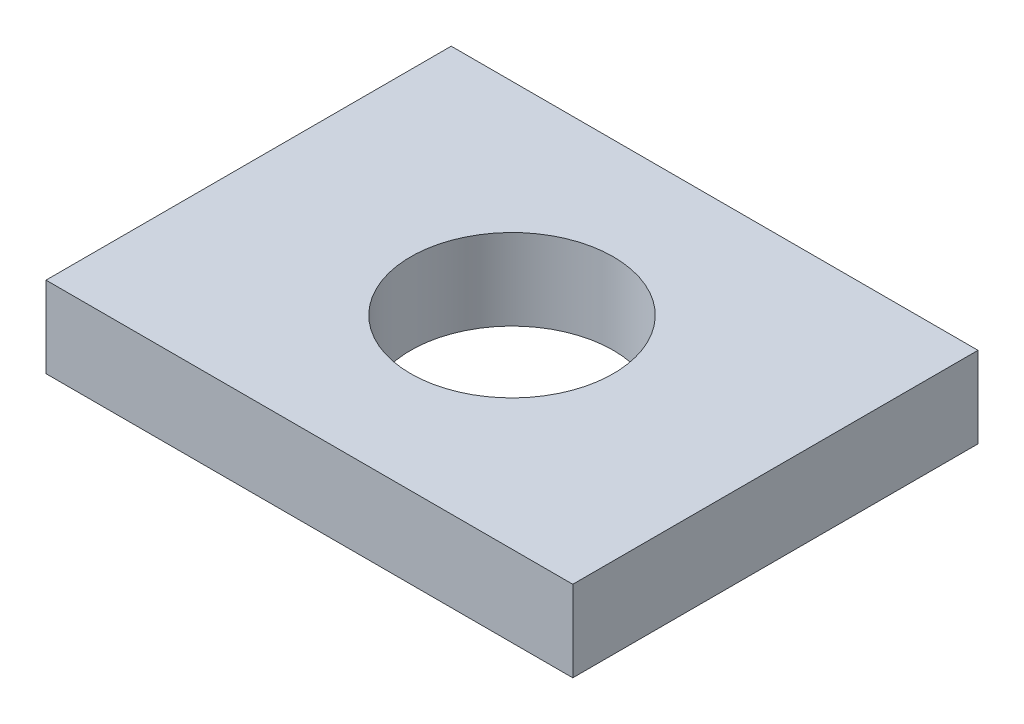
ISO-10303-21;
HEADER;
FILE_DESCRIPTION(('STEP AP214'),'2;1');
FILE_NAME('part.step','',(''),(''),'','','');
FILE_SCHEMA(('AUTOMOTIVE_DESIGN { 1 0 10303 214 1 1 1 1 }'));
ENDSEC;
DATA;
#1=APPLICATION_CONTEXT('core data for automotive mechanical design processes');
#2=APPLICATION_PROTOCOL_DEFINITION('international standard','automotive_design',2000,#1);
#3=PRODUCT_CONTEXT('',#1,'mechanical');
#4=PRODUCT('Part','Part','',(#3));
#5=PRODUCT_RELATED_PRODUCT_CATEGORY('part','',(#4));
#6=PRODUCT_DEFINITION_FORMATION('','',#4);
#7=PRODUCT_DEFINITION_CONTEXT('part definition',#1,'design');
#8=PRODUCT_DEFINITION('design','',#6,#7);
#9=PRODUCT_DEFINITION_SHAPE('','',#8);
#10=(LENGTH_UNIT() NAMED_UNIT(*) SI_UNIT(.MILLI.,.METRE.));
#11=(NAMED_UNIT(*) PLANE_ANGLE_UNIT() SI_UNIT($,.RADIAN.));
#12=(NAMED_UNIT(*) SI_UNIT($,.STERADIAN.) SOLID_ANGLE_UNIT());
#13=UNCERTAINTY_MEASURE_WITH_UNIT(LENGTH_MEASURE(1.E-05),#10,'distance_accuracy_value','');
#14=(GEOMETRIC_REPRESENTATION_CONTEXT(3) GLOBAL_UNCERTAINTY_ASSIGNED_CONTEXT((#13)) GLOBAL_UNIT_ASSIGNED_CONTEXT((#10,
#11,#12)) REPRESENTATION_CONTEXT('',''));
#15=CARTESIAN_POINT('',(0.,0.,0.));
#16=DIRECTION('',(0.,0.,1.));
#17=DIRECTION('',(1.,0.,0.));
#18=AXIS2_PLACEMENT_3D('',#15,#16,#17);
#19=CARTESIAN_POINT('',(0.,2.,0.));
#20=DIRECTION('',(0.,-1.,0.));
#21=DIRECTION('',(0.,0.,-1.));
#22=AXIS2_PLACEMENT_3D('',#19,#20,#21);
#23=PLANE('',#22);
#24=DIRECTION('',(0.,0.,-1.));
#25=VECTOR('',#24,1.);
#26=CARTESIAN_POINT('',(6.5,2.,5.));
#27=LINE('',#26,#25);
#28=CARTESIAN_POINT('',(6.5,2.,5.));
#29=VERTEX_POINT('',#28);
#30=CARTESIAN_POINT('',(6.5,2.,-5.));
#31=VERTEX_POINT('',#30);
#32=EDGE_CURVE('E96',#29,#31,#27,.T.);
#33=ORIENTED_EDGE('',*,*,#32,.T.);
#34=DIRECTION('',(-1.,0.,0.));
#35=VECTOR('',#34,1.);
#36=CARTESIAN_POINT('',(-6.5,2.,-5.));
#37=LINE('',#36,#35);
#38=CARTESIAN_POINT('',(-6.5,2.,-5.));
#39=VERTEX_POINT('',#38);
#40=EDGE_CURVE('E91',#31,#39,#37,.T.);
#41=ORIENTED_EDGE('',*,*,#40,.T.);
#42=DIRECTION('',(0.,0.,1.));
#43=VECTOR('',#42,1.);
#44=CARTESIAN_POINT('',(-6.5,2.,5.));
#45=LINE('',#44,#43);
#46=CARTESIAN_POINT('',(-6.5,2.,5.));
#47=VERTEX_POINT('',#46);
#48=EDGE_CURVE('E94',#39,#47,#45,.T.);
#49=ORIENTED_EDGE('',*,*,#48,.T.);
#50=DIRECTION('',(1.,0.,0.));
#51=VECTOR('',#50,1.);
#52=CARTESIAN_POINT('',(-6.5,2.,5.));
#53=LINE('',#52,#51);
#54=EDGE_CURVE('E61',#47,#29,#53,.T.);
#55=ORIENTED_EDGE('',*,*,#54,.T.);
#56=EDGE_LOOP('',(#33,#41,#49,#55));
#57=FACE_BOUND('',#56,.T.);
#58=CARTESIAN_POINT('',(0.,2.,0.));
#59=DIRECTION('',(0.,1.,0.));
#60=DIRECTION('',(0.,0.,1.));
#61=AXIS2_PLACEMENT_3D('',#58,#59,#60);
#62=CIRCLE('',#61,2.5);
#63=CARTESIAN_POINT('',(0.,2.,2.5));
#64=VERTEX_POINT('',#63);
#65=EDGE_CURVE('E116',#64,#64,#62,.T.);
#66=ORIENTED_EDGE('',*,*,#65,.F.);
#67=EDGE_LOOP('',(#66));
#68=FACE_BOUND('',#67,.T.);
#69=ADVANCED_FACE('F43',(#57,#68),#23,.F.);
#70=CARTESIAN_POINT('',(0.,0.,0.));
#71=DIRECTION('',(0.,-1.,0.));
#72=DIRECTION('',(0.,0.,-1.));
#73=AXIS2_PLACEMENT_3D('',#70,#71,#72);
#74=PLANE('',#73);
#75=DIRECTION('',(0.,0.,-1.));
#76=VECTOR('',#75,1.);
#77=CARTESIAN_POINT('',(6.5,0.,5.));
#78=LINE('',#77,#76);
#79=CARTESIAN_POINT('',(6.5,0.,5.));
#80=VERTEX_POINT('',#79);
#81=CARTESIAN_POINT('',(6.5,0.,-5.));
#82=VERTEX_POINT('',#81);
#83=EDGE_CURVE('E112',#80,#82,#78,.T.);
#84=ORIENTED_EDGE('',*,*,#83,.F.);
#85=DIRECTION('',(1.,0.,0.));
#86=VECTOR('',#85,1.);
#87=CARTESIAN_POINT('',(-6.5,0.,5.));
#88=LINE('',#87,#86);
#89=CARTESIAN_POINT('',(-6.5,0.,5.));
#90=VERTEX_POINT('',#89);
#91=EDGE_CURVE('E84',#90,#80,#88,.T.);
#92=ORIENTED_EDGE('',*,*,#91,.F.);
#93=DIRECTION('',(0.,0.,1.));
#94=VECTOR('',#93,1.);
#95=CARTESIAN_POINT('',(-6.5,0.,5.));
#96=LINE('',#95,#94);
#97=CARTESIAN_POINT('',(-6.5,0.,-5.));
#98=VERTEX_POINT('',#97);
#99=EDGE_CURVE('E78',#98,#90,#96,.T.);
#100=ORIENTED_EDGE('',*,*,#99,.F.);
#101=DIRECTION('',(-1.,0.,0.));
#102=VECTOR('',#101,1.);
#103=CARTESIAN_POINT('',(-6.5,0.,-5.));
#104=LINE('',#103,#102);
#105=EDGE_CURVE('E101',#82,#98,#104,.T.);
#106=ORIENTED_EDGE('',*,*,#105,.F.);
#107=EDGE_LOOP('',(#84,#92,#100,#106));
#108=FACE_BOUND('',#107,.T.);
#109=CARTESIAN_POINT('',(0.,0.,0.));
#110=DIRECTION('',(0.,1.,0.));
#111=DIRECTION('',(0.,0.,1.));
#112=AXIS2_PLACEMENT_3D('',#109,#110,#111);
#113=CIRCLE('',#112,2.5);
#114=CARTESIAN_POINT('',(0.,0.,2.5));
#115=VERTEX_POINT('',#114);
#116=EDGE_CURVE('E134',#115,#115,#113,.T.);
#117=ORIENTED_EDGE('',*,*,#116,.T.);
#118=EDGE_LOOP('',(#117));
#119=FACE_BOUND('',#118,.T.);
#120=ADVANCED_FACE('F129',(#108,#119),#74,.T.);
#121=CARTESIAN_POINT('',(6.5,2.,5.));
#122=DIRECTION('',(-1.,0.,0.));
#123=DIRECTION('',(0.,0.,1.));
#124=AXIS2_PLACEMENT_3D('',#121,#122,#123);
#125=PLANE('',#124);
#126=ORIENTED_EDGE('',*,*,#83,.T.);
#127=DIRECTION('',(0.,-1.,0.));
#128=VECTOR('',#127,1.);
#129=CARTESIAN_POINT('',(6.5,2.,-5.));
#130=LINE('',#129,#128);
#131=EDGE_CURVE('E11',#31,#82,#130,.T.);
#132=ORIENTED_EDGE('',*,*,#131,.F.);
#133=ORIENTED_EDGE('',*,*,#32,.F.);
#134=DIRECTION('',(0.,-1.,0.));
#135=VECTOR('',#134,1.);
#136=CARTESIAN_POINT('',(6.5,2.,5.));
#137=LINE('',#136,#135);
#138=EDGE_CURVE('E108',#29,#80,#137,.T.);
#139=ORIENTED_EDGE('',*,*,#138,.T.);
#140=EDGE_LOOP('',(#126,#132,#133,#139));
#141=FACE_BOUND('',#140,.T.);
#142=ADVANCED_FACE('F45',(#141),#125,.F.);
#143=CARTESIAN_POINT('',(-6.5,2.,-5.));
#144=DIRECTION('',(0.,0.,1.));
#145=DIRECTION('',(1.,0.,0.));
#146=AXIS2_PLACEMENT_3D('',#143,#144,#145);
#147=PLANE('',#146);
#148=ORIENTED_EDGE('',*,*,#105,.T.);
#149=DIRECTION('',(0.,-1.,0.));
#150=VECTOR('',#149,1.);
#151=CARTESIAN_POINT('',(-6.5,2.,-5.));
#152=LINE('',#151,#150);
#153=EDGE_CURVE('E53',#39,#98,#152,.T.);
#154=ORIENTED_EDGE('',*,*,#153,.F.);
#155=ORIENTED_EDGE('',*,*,#40,.F.);
#156=ORIENTED_EDGE('',*,*,#131,.T.);
#157=EDGE_LOOP('',(#148,#154,#155,#156));
#158=FACE_BOUND('',#157,.T.);
#159=ADVANCED_FACE('F100',(#158),#147,.F.);
#160=CARTESIAN_POINT('',(-6.5,2.,5.));
#161=DIRECTION('',(1.,0.,0.));
#162=DIRECTION('',(0.,0.,-1.));
#163=AXIS2_PLACEMENT_3D('',#160,#161,#162);
#164=PLANE('',#163);
#165=ORIENTED_EDGE('',*,*,#99,.T.);
#166=DIRECTION('',(0.,-1.,0.));
#167=VECTOR('',#166,1.);
#168=CARTESIAN_POINT('',(-6.5,2.,5.));
#169=LINE('',#168,#167);
#170=EDGE_CURVE('E103',#47,#90,#169,.T.);
#171=ORIENTED_EDGE('',*,*,#170,.F.);
#172=ORIENTED_EDGE('',*,*,#48,.F.);
#173=ORIENTED_EDGE('',*,*,#153,.T.);
#174=EDGE_LOOP('',(#165,#171,#172,#173));
#175=FACE_BOUND('',#174,.T.);
#176=ADVANCED_FACE('F104',(#175),#164,.F.);
#177=CARTESIAN_POINT('',(-6.5,2.,5.));
#178=DIRECTION('',(0.,0.,-1.));
#179=DIRECTION('',(-1.,0.,0.));
#180=AXIS2_PLACEMENT_3D('',#177,#178,#179);
#181=PLANE('',#180);
#182=ORIENTED_EDGE('',*,*,#91,.T.);
#183=ORIENTED_EDGE('',*,*,#138,.F.);
#184=ORIENTED_EDGE('',*,*,#54,.F.);
#185=ORIENTED_EDGE('',*,*,#170,.T.);
#186=EDGE_LOOP('',(#182,#183,#184,#185));
#187=FACE_BOUND('',#186,.T.);
#188=ADVANCED_FACE('F126',(#187),#181,.F.);
#189=CARTESIAN_POINT('',(0.,2.,0.));
#190=DIRECTION('',(0.,-1.,0.));
#191=DIRECTION('',(0.,0.,-1.));
#192=AXIS2_PLACEMENT_3D('',#189,#190,#191);
#193=CYLINDRICAL_SURFACE('',#192,2.5);
#194=ORIENTED_EDGE('',*,*,#65,.T.);
#195=EDGE_LOOP('',(#194));
#196=FACE_BOUND('',#195,.T.);
#197=ORIENTED_EDGE('',*,*,#116,.F.);
#198=EDGE_LOOP('',(#197));
#199=FACE_BOUND('',#198,.T.);
#200=ADVANCED_FACE('F142',(#196,#199),#193,.F.);
#201=CLOSED_SHELL('',(#69,#120,#142,#159,#176,#188,#200));
#202=MANIFOLD_SOLID_BREP('B2',#201);
#203=ADVANCED_BREP_SHAPE_REPRESENTATION('',(#18,#202),#14);
#204=SHAPE_DEFINITION_REPRESENTATION(#9,#203);
ENDSEC;
END-ISO-10303-21;
